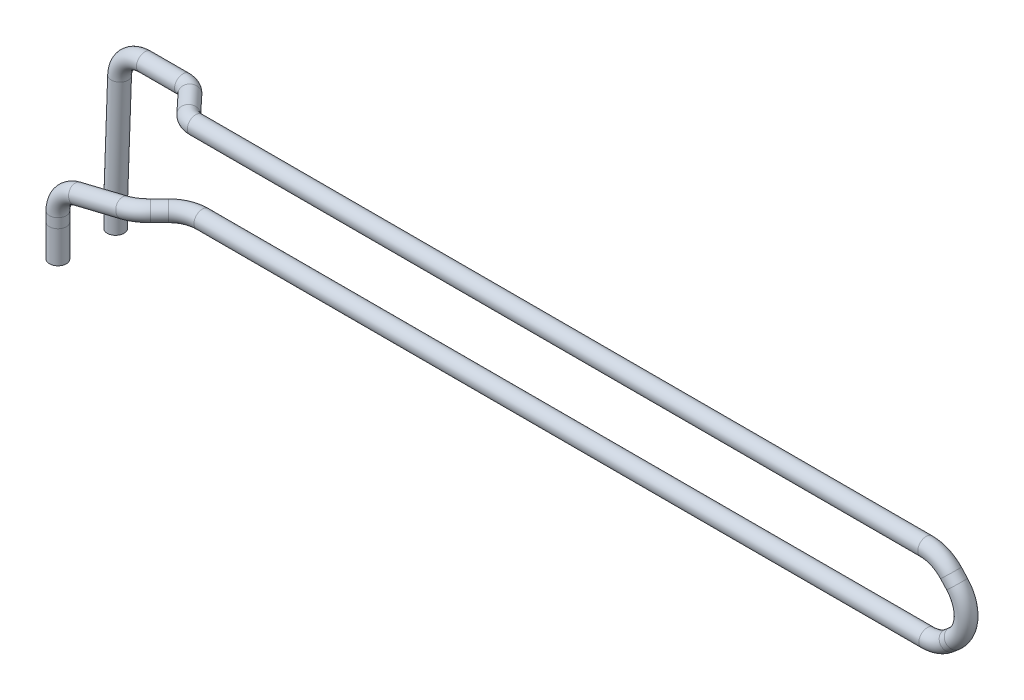
ISO-10303-21;
HEADER;
FILE_DESCRIPTION(('STEP AP214'),'2;1');
FILE_NAME('part.step','',(''),(''),'','','');
FILE_SCHEMA(('AUTOMOTIVE_DESIGN { 1 0 10303 214 1 1 1 1 }'));
ENDSEC;
DATA;
#1=APPLICATION_CONTEXT('core data for automotive mechanical design processes');
#2=APPLICATION_PROTOCOL_DEFINITION('international standard','automotive_design',2000,#1);
#3=PRODUCT_CONTEXT('',#1,'mechanical');
#4=PRODUCT('Part','Part','',(#3));
#5=PRODUCT_RELATED_PRODUCT_CATEGORY('part','',(#4));
#6=PRODUCT_DEFINITION_FORMATION('','',#4);
#7=PRODUCT_DEFINITION_CONTEXT('part definition',#1,'design');
#8=PRODUCT_DEFINITION('design','',#6,#7);
#9=PRODUCT_DEFINITION_SHAPE('','',#8);
#10=(LENGTH_UNIT() NAMED_UNIT(*) SI_UNIT(.MILLI.,.METRE.));
#11=(NAMED_UNIT(*) PLANE_ANGLE_UNIT() SI_UNIT($,.RADIAN.));
#12=(NAMED_UNIT(*) SI_UNIT($,.STERADIAN.) SOLID_ANGLE_UNIT());
#13=UNCERTAINTY_MEASURE_WITH_UNIT(LENGTH_MEASURE(1.E-05),#10,'distance_accuracy_value','');
#14=(GEOMETRIC_REPRESENTATION_CONTEXT(3) GLOBAL_UNCERTAINTY_ASSIGNED_CONTEXT((#13)) GLOBAL_UNIT_ASSIGNED_CONTEXT((#10,
#11,#12)) REPRESENTATION_CONTEXT('',''));
#15=CARTESIAN_POINT('',(0.,0.,0.));
#16=DIRECTION('',(0.,0.,1.));
#17=DIRECTION('',(1.,0.,0.));
#18=AXIS2_PLACEMENT_3D('',#15,#16,#17);
#19=CARTESIAN_POINT('',(-57.8477688580534,-14.4504268447309,-3.16147066816918));
#20=DIRECTION('',(0.,1.,0.));
#21=DIRECTION('',(0.,0.,1.));
#22=AXIS2_PLACEMENT_3D('',#19,#20,#21);
#23=PLANE('',#22);
#24=CARTESIAN_POINT('',(-57.8477688580534,-14.4504268447309,-3.16147066816918));
#25=DIRECTION('',(0.,1.,0.));
#26=DIRECTION('',(0.,0.,1.));
#27=AXIS2_PLACEMENT_3D('',#24,#25,#26);
#28=CIRCLE('',#27,1.);
#29=CARTESIAN_POINT('',(-57.8477688580534,-14.4504268447309,-2.16147066816917));
#30=VERTEX_POINT('',#29);
#31=EDGE_CURVE('E52',#30,#30,#28,.T.);
#32=ORIENTED_EDGE('',*,*,#31,.F.);
#33=EDGE_LOOP('',(#32));
#34=FACE_BOUND('',#33,.T.);
#35=ADVANCED_FACE('F49',(#34),#23,.F.);
#36=CARTESIAN_POINT('',(-58.0906123687134,-14.4017319108807,3.44671250446354));
#37=DIRECTION('',(0.,-1.,0.));
#38=DIRECTION('',(0.0991975804914857,0.,0.995067756499343));
#39=AXIS2_PLACEMENT_3D('',#36,#37,#38);
#40=PLANE('',#39);
#41=CARTESIAN_POINT('',(-58.0906123687134,-14.4017319108807,3.44671250446354));
#42=DIRECTION('',(0.,-1.,0.));
#43=DIRECTION('',(0.0991975804914857,0.,0.995067756499343));
#44=AXIS2_PLACEMENT_3D('',#41,#42,#43);
#45=CIRCLE('',#44,1.);
#46=CARTESIAN_POINT('',(-57.9914147882219,-14.4017319108807,4.44178026096289));
#47=VERTEX_POINT('',#46);
#48=EDGE_CURVE('E11',#47,#47,#45,.T.);
#49=ORIENTED_EDGE('',*,*,#48,.T.);
#50=EDGE_LOOP('',(#49));
#51=FACE_BOUND('',#50,.T.);
#52=ADVANCED_FACE('F78',(#51),#40,.T.);
#53=CARTESIAN_POINT('',(-57.8477688580534,-11.3655003498176,-3.16147066816918));
#54=DIRECTION('',(0.,-1.,0.));
#55=DIRECTION('',(0.,0.,-1.));
#56=AXIS2_PLACEMENT_3D('',#53,#54,#55);
#57=CYLINDRICAL_SURFACE('',#56,1.);
#58=CARTESIAN_POINT('',(-57.8477688580534,-11.5655003498176,-3.16147066816917));
#59=DIRECTION('',(-0.0178043012079039,-0.999841490866677,0.));
#60=DIRECTION('',(-0.999841490866677,0.0178043012079039,0.));
#61=AXIS2_PLACEMENT_3D('',#58,#59,#60);
#62=ELLIPSE('',#61,1.00015853426245,1.);
#63=CARTESIAN_POINT('',(-58.8477688580534,-11.547693226018,-3.16147066816917));
#64=VERTEX_POINT('',#63);
#65=EDGE_CURVE('E64',#64,#64,#62,.T.);
#66=ORIENTED_EDGE('',*,*,#65,.T.);
#67=EDGE_LOOP('',(#66));
#68=FACE_BOUND('',#67,.T.);
#69=ORIENTED_EDGE('',*,*,#31,.T.);
#70=EDGE_LOOP('',(#69));
#71=FACE_BOUND('',#70,.T.);
#72=ADVANCED_FACE('F75',(#68,#71),#57,.T.);
#73=CARTESIAN_POINT('',(-58.0906123687134,-14.4017319108807,3.44671250446354));
#74=DIRECTION('',(0.,1.,0.));
#75=DIRECTION('',(0.,0.,1.));
#76=AXIS2_PLACEMENT_3D('',#73,#74,#75);
#77=CYLINDRICAL_SURFACE('',#76,1.);
#78=CARTESIAN_POINT('',(-58.0906123687134,-10.5909190140778,3.44671250446355));
#79=DIRECTION('',(0.,-1.,0.));
#80=DIRECTION('',(0.0991975804914857,0.,0.995067756499343));
#81=AXIS2_PLACEMENT_3D('',#78,#79,#80);
#82=CIRCLE('',#81,1.);
#83=CARTESIAN_POINT('',(-57.9914147882219,-10.5909190140778,4.44178026096289));
#84=VERTEX_POINT('',#83);
#85=EDGE_CURVE('E56',#84,#84,#82,.T.);
#86=ORIENTED_EDGE('',*,*,#85,.T.);
#87=EDGE_LOOP('',(#86));
#88=FACE_BOUND('',#87,.T.);
#89=ORIENTED_EDGE('',*,*,#48,.F.);
#90=EDGE_LOOP('',(#89));
#91=FACE_BOUND('',#90,.T.);
#92=ADVANCED_FACE('F97',(#88,#91),#77,.T.);
#93=CARTESIAN_POINT('',(-58.0906123687134,-10.5909190140778,3.44671250446355));
#94=DIRECTION('',(0.,1.,0.));
#95=DIRECTION('',(0.,0.,1.));
#96=AXIS2_PLACEMENT_3D('',#93,#94,#95);
#97=CYLINDRICAL_SURFACE('',#96,1.);
#98=CARTESIAN_POINT('',(-58.0906123687134,-9.45535480034576,3.44671250446355));
#99=DIRECTION('',(0.,-1.,0.));
#100=DIRECTION('',(0.0991975804914857,0.,0.995067756499343));
#101=AXIS2_PLACEMENT_3D('',#98,#99,#100);
#102=CIRCLE('',#101,1.);
#103=CARTESIAN_POINT('',(-59.0906123687134,-9.45535480034576,3.44671250446355));
#104=VERTEX_POINT('',#103);
#105=EDGE_CURVE('E61',#104,#104,#102,.T.);
#106=ORIENTED_EDGE('',*,*,#105,.T.);
#107=EDGE_LOOP('',(#106));
#108=FACE_BOUND('',#107,.T.);
#109=ORIENTED_EDGE('',*,*,#85,.F.);
#110=EDGE_LOOP('',(#109));
#111=FACE_BOUND('',#110,.T.);
#112=ADVANCED_FACE('F103',(#108,#111),#97,.T.);
#113=CARTESIAN_POINT('',(-55.0906123687134,-9.45535480034575,3.44671250446355));
#114=DIRECTION('',(0.,0.,-1.));
#115=DIRECTION('',(-1.,0.,0.));
#116=AXIS2_PLACEMENT_3D('',#113,#114,#115);
#117=TOROIDAL_SURFACE('',#116,3.,1.);
#118=CARTESIAN_POINT('',(-55.8006105061255,-6.54058162823247,3.44671250446355));
#119=DIRECTION('',(-0.971591057371097,-0.236666045804028,0.));
#120=DIRECTION('',(0.0234766991282467,-0.0963794821183771,0.995067756499343));
#121=AXIS2_PLACEMENT_3D('',#118,#119,#120);
#122=CIRCLE('',#121,1.);
#123=CARTESIAN_POINT('',(-56.0372765519295,-5.56899057086137,3.44671250446355));
#124=VERTEX_POINT('',#123);
#125=EDGE_CURVE('E228',#124,#124,#122,.T.);
#126=CARTESIAN_POINT('',(-55.0906123687134,-9.45535480034575,3.44671250446355));
#127=DIRECTION('',(0.,0.,-1.));
#128=DIRECTION('',(-1.,0.,0.));
#129=AXIS2_PLACEMENT_3D('',#126,#127,#128);
#130=CIRCLE('',#129,4.);
#131=EDGE_CURVE('',#104,#124,#130,.T.);
#132=ORIENTED_EDGE('',*,*,#105,.F.);
#133=ORIENTED_EDGE('',*,*,#125,.T.);
#134=ORIENTED_EDGE('',*,*,#131,.T.);
#135=ORIENTED_EDGE('',*,*,#131,.F.);
#136=EDGE_LOOP('',(#132,#134,#133,#135));
#137=FACE_BOUND('',#136,.T.);
#138=ADVANCED_FACE('F108',(#137),#117,.T.);
#139=CARTESIAN_POINT('',(-55.8006105061255,-6.54058162823247,3.44671250446355));
#140=DIRECTION('',(0.971591057371097,0.236666045804028,0.));
#141=DIRECTION('',(-0.236666045804028,0.971591057371097,0.));
#142=AXIS2_PLACEMENT_3D('',#139,#140,#141);
#143=CYLINDRICAL_SURFACE('',#142,1.);
#144=CARTESIAN_POINT('',(-50.1950748013559,-5.17515122436409,3.44671250446355));
#145=DIRECTION('',(-0.971591057371097,-0.236666045804028,0.));
#146=DIRECTION('',(0.0234766991282467,-0.0963794821183771,0.995067756499343));
#147=AXIS2_PLACEMENT_3D('',#144,#145,#146);
#148=CIRCLE('',#147,1.);
#149=CARTESIAN_POINT('',(-50.2495799747924,-4.95138976795612,4.41983120056122));
#150=VERTEX_POINT('',#149);
#151=EDGE_CURVE('E225',#150,#150,#148,.T.);
#152=ORIENTED_EDGE('',*,*,#151,.T.);
#153=EDGE_LOOP('',(#152));
#154=FACE_BOUND('',#153,.T.);
#155=ORIENTED_EDGE('',*,*,#125,.F.);
#156=EDGE_LOOP('',(#155));
#157=FACE_BOUND('',#156,.T.);
#158=ADVANCED_FACE('F116',(#154,#157),#143,.T.);
#159=CARTESIAN_POINT('',(-50.0315592810462,-5.84643559358797,0.527356416170526));
#160=DIRECTION('',(-0.230304153903409,0.945473422889122,-0.230304153903404));
#161=DIRECTION('',(-0.971591057371097,-0.236666045804029,0.));
#162=AXIS2_PLACEMENT_3D('',#159,#160,#161);
#163=TOROIDAL_SURFACE('',#162,3.,1.);
#164=CARTESIAN_POINT('',(-48.0259072747765,-4.86933781982481,2.53300842244018));
#165=DIRECTION('',(-0.707106781186542,0.,0.707106781186553));
#166=DIRECTION('',(0.707106781186553,0.,0.707106781186542));
#167=AXIS2_PLACEMENT_3D('',#164,#165,#166);
#168=CIRCLE('',#167,1.);
#169=CARTESIAN_POINT('',(-47.3573566060199,-4.54363856190375,3.20155909119673));
#170=VERTEX_POINT('',#169);
#171=EDGE_CURVE('E222',#170,#170,#168,.T.);
#172=CARTESIAN_POINT('',(-50.0315592810462,-5.84643559358797,0.527356416170526));
#173=DIRECTION('',(-0.230304153903409,0.945473422889122,-0.230304153903404));
#174=DIRECTION('',(-0.971591057371097,-0.236666045804029,0.));
#175=AXIS2_PLACEMENT_3D('',#172,#173,#174);
#176=CIRCLE('',#175,4.);
#177=EDGE_CURVE('',#150,#170,#176,.T.);
#178=ORIENTED_EDGE('',*,*,#151,.F.);
#179=ORIENTED_EDGE('',*,*,#171,.T.);
#180=ORIENTED_EDGE('',*,*,#177,.T.);
#181=ORIENTED_EDGE('',*,*,#177,.F.);
#182=EDGE_LOOP('',(#178,#180,#179,#181));
#183=FACE_BOUND('',#182,.T.);
#184=ADVANCED_FACE('F123',(#183),#163,.T.);
#185=CARTESIAN_POINT('',(-48.0259072747765,-4.86933781982481,2.53300842244017));
#186=DIRECTION('',(0.707106781186541,0.,-0.707106781186554));
#187=DIRECTION('',(-0.707106781186554,0.,-0.707106781186541));
#188=AXIS2_PLACEMENT_3D('',#185,#186,#187);
#189=CYLINDRICAL_SURFACE('',#188,1.);
#190=CARTESIAN_POINT('',(-46.9440415045686,-4.86933781982481,1.45114265223225));
#191=DIRECTION('',(-0.707106781186541,0.,0.707106781186554));
#192=DIRECTION('',(0.707106781186554,0.,0.707106781186541));
#193=AXIS2_PLACEMENT_3D('',#190,#191,#192);
#194=CIRCLE('',#193,1.);
#195=CARTESIAN_POINT('',(-47.6511482857552,-4.86933781982481,0.744035871045712));
#196=VERTEX_POINT('',#195);
#197=EDGE_CURVE('E219',#196,#196,#194,.T.);
#198=ORIENTED_EDGE('',*,*,#197,.T.);
#199=EDGE_LOOP('',(#198));
#200=FACE_BOUND('',#199,.T.);
#201=ORIENTED_EDGE('',*,*,#171,.F.);
#202=EDGE_LOOP('',(#201));
#203=FACE_BOUND('',#202,.T.);
#204=ADVANCED_FACE('F127',(#200,#203),#189,.T.);
#205=CARTESIAN_POINT('',(-44.1156143798224,-4.8693378198248,4.27956977697841));
#206=DIRECTION('',(0.,-1.,0.));
#207=DIRECTION('',(0.,0.,-1.));
#208=AXIS2_PLACEMENT_3D('',#205,#206,#207);
#209=TOROIDAL_SURFACE('',#208,4.,1.);
#210=CARTESIAN_POINT('',(-44.1156143798224,-4.8693378198248,0.279569776978414));
#211=DIRECTION('',(-1.,0.,0.));
#212=DIRECTION('',(0.,0.,1.));
#213=AXIS2_PLACEMENT_3D('',#210,#211,#212);
#214=CIRCLE('',#213,1.);
#215=CARTESIAN_POINT('',(-44.1156143798224,-4.8693378198248,-0.720430223021586));
#216=VERTEX_POINT('',#215);
#217=EDGE_CURVE('E216',#216,#216,#214,.T.);
#218=CARTESIAN_POINT('',(-44.1156143798224,-4.8693378198248,4.27956977697841));
#219=DIRECTION('',(0.,-1.,0.));
#220=DIRECTION('',(0.,0.,-1.));
#221=AXIS2_PLACEMENT_3D('',#218,#219,#220);
#222=CIRCLE('',#221,5.);
#223=EDGE_CURVE('',#196,#216,#222,.T.);
#224=ORIENTED_EDGE('',*,*,#197,.F.);
#225=ORIENTED_EDGE('',*,*,#217,.T.);
#226=ORIENTED_EDGE('',*,*,#223,.T.);
#227=ORIENTED_EDGE('',*,*,#223,.F.);
#228=EDGE_LOOP('',(#224,#226,#225,#227));
#229=FACE_BOUND('',#228,.T.);
#230=ADVANCED_FACE('F131',(#229),#209,.T.);
#231=CARTESIAN_POINT('',(-44.1156143798224,-4.8693378198248,0.279569776978414));
#232=DIRECTION('',(1.,0.,0.));
#233=DIRECTION('',(0.,0.,-1.));
#234=AXIS2_PLACEMENT_3D('',#231,#232,#233);
#235=CYLINDRICAL_SURFACE('',#234,1.);
#236=CARTESIAN_POINT('',(41.8919105632454,-4.8693378198248,0.279569776978414));
#237=DIRECTION('',(-1.,0.,0.));
#238=DIRECTION('',(0.,0.,1.));
#239=AXIS2_PLACEMENT_3D('',#236,#237,#238);
#240=CIRCLE('',#239,1.);
#241=CARTESIAN_POINT('',(41.8919105632454,-5.8693378198248,0.279569776978414));
#242=VERTEX_POINT('',#241);
#243=EDGE_CURVE('E213',#242,#242,#240,.T.);
#244=ORIENTED_EDGE('',*,*,#243,.T.);
#245=EDGE_LOOP('',(#244));
#246=FACE_BOUND('',#245,.T.);
#247=ORIENTED_EDGE('',*,*,#217,.F.);
#248=EDGE_LOOP('',(#247));
#249=FACE_BOUND('',#248,.T.);
#250=ADVANCED_FACE('F135',(#246,#249),#235,.T.);
#251=CARTESIAN_POINT('',(41.8919105632455,-0.869337819824794,0.279569776978413));
#252=DIRECTION('',(0.,0.,1.));
#253=DIRECTION('',(0.,-1.,0.));
#254=AXIS2_PLACEMENT_3D('',#251,#252,#253);
#255=TOROIDAL_SURFACE('',#254,4.00000000000001,1.);
#256=CARTESIAN_POINT('',(44.4939840949807,-3.90729985636225,0.279569776978414));
#257=DIRECTION('',(-0.759490509134361,-0.650518382933818,0.));
#258=DIRECTION('',(0.,0.,1.));
#259=AXIS2_PLACEMENT_3D('',#256,#257,#258);
#260=CIRCLE('',#259,1.);
#261=CARTESIAN_POINT('',(45.1445024779145,-4.66679036549661,0.279569776978415));
#262=VERTEX_POINT('',#261);
#263=EDGE_CURVE('E210',#262,#262,#260,.T.);
#264=CARTESIAN_POINT('',(41.8919105632455,-0.869337819824794,0.279569776978413));
#265=DIRECTION('',(0.,0.,1.));
#266=DIRECTION('',(0.,-1.,0.));
#267=AXIS2_PLACEMENT_3D('',#264,#265,#266);
#268=CIRCLE('',#267,5.00000000000001);
#269=EDGE_CURVE('',#242,#262,#268,.T.);
#270=ORIENTED_EDGE('',*,*,#243,.F.);
#271=ORIENTED_EDGE('',*,*,#263,.T.);
#272=ORIENTED_EDGE('',*,*,#269,.T.);
#273=ORIENTED_EDGE('',*,*,#269,.F.);
#274=EDGE_LOOP('',(#270,#272,#271,#273));
#275=FACE_BOUND('',#274,.T.);
#276=ADVANCED_FACE('F139',(#275),#255,.T.);
#277=CARTESIAN_POINT('',(44.4939840949807,-3.90729985636224,0.279569776978413));
#278=DIRECTION('',(0.759490509134367,0.65051838293381,0.));
#279=DIRECTION('',(-0.65051838293381,0.759490509134367,0.));
#280=AXIS2_PLACEMENT_3D('',#277,#278,#279);
#281=CYLINDRICAL_SURFACE('',#280,1.);
#282=CARTESIAN_POINT('',(45.0971966572189,-3.39063657244609,0.279569776978413));
#283=DIRECTION('',(-0.759490509134367,-0.650518382933811,0.));
#284=DIRECTION('',(0.,0.,1.));
#285=AXIS2_PLACEMENT_3D('',#282,#283,#284);
#286=CIRCLE('',#285,1.);
#287=CARTESIAN_POINT('',(45.7477150401527,-4.15012708158046,0.279569776978413));
#288=VERTEX_POINT('',#287);
#289=EDGE_CURVE('E207',#288,#288,#286,.T.);
#290=ORIENTED_EDGE('',*,*,#289,.T.);
#291=EDGE_LOOP('',(#290));
#292=FACE_BOUND('',#291,.T.);
#293=ORIENTED_EDGE('',*,*,#263,.F.);
#294=EDGE_LOOP('',(#293));
#295=FACE_BOUND('',#294,.T.);
#296=ADVANCED_FACE('F143',(#292,#295),#281,.T.);
#297=CARTESIAN_POINT('',(42.4951231254836,-0.352674535908644,0.279569776978414));
#298=DIRECTION('',(0.,0.,1.));
#299=DIRECTION('',(0.,-1.,0.));
#300=AXIS2_PLACEMENT_3D('',#297,#298,#299);
#301=TOROIDAL_SURFACE('',#300,4.00000000000001,1.);
#302=CARTESIAN_POINT('',(45.4260549396111,2.36939061778166,0.279569776978413));
#303=DIRECTION('',(0.680516288422575,-0.732732953531887,0.));
#304=DIRECTION('',(0.,0.,1.));
#305=AXIS2_PLACEMENT_3D('',#302,#303,#304);
#306=CIRCLE('',#305,1.);
#307=CARTESIAN_POINT('',(46.158787893143,3.04990690620424,0.279569776978413));
#308=VERTEX_POINT('',#307);
#309=EDGE_CURVE('E204',#308,#308,#306,.T.);
#310=CARTESIAN_POINT('',(42.4951231254836,-0.352674535908644,0.279569776978414));
#311=DIRECTION('',(0.,0.,1.));
#312=DIRECTION('',(0.,-1.,0.));
#313=AXIS2_PLACEMENT_3D('',#310,#311,#312);
#314=CIRCLE('',#313,5.00000000000001);
#315=EDGE_CURVE('',#288,#308,#314,.T.);
#316=ORIENTED_EDGE('',*,*,#289,.F.);
#317=ORIENTED_EDGE('',*,*,#309,.T.);
#318=ORIENTED_EDGE('',*,*,#315,.T.);
#319=ORIENTED_EDGE('',*,*,#315,.F.);
#320=EDGE_LOOP('',(#316,#318,#317,#319));
#321=FACE_BOUND('',#320,.T.);
#322=ADVANCED_FACE('F147',(#321),#301,.T.);
#323=CARTESIAN_POINT('',(45.4260549396111,2.36939061778167,0.279569776978413));
#324=DIRECTION('',(-0.680516288422577,0.732732953531886,0.));
#325=DIRECTION('',(-0.732732953531886,-0.680516288422577,0.));
#326=AXIS2_PLACEMENT_3D('',#323,#324,#325);
#327=CYLINDRICAL_SURFACE('',#326,1.);
#328=CARTESIAN_POINT('',(44.6924518934593,3.15928372669292,0.279569776978413));
#329=DIRECTION('',(0.680516288422577,-0.732732953531886,0.));
#330=DIRECTION('',(0.,0.,1.));
#331=AXIS2_PLACEMENT_3D('',#328,#329,#330);
#332=CIRCLE('',#331,1.);
#333=CARTESIAN_POINT('',(45.4251848469911,3.83980001511549,0.279569776978413));
#334=VERTEX_POINT('',#333);
#335=EDGE_CURVE('E201',#334,#334,#332,.T.);
#336=ORIENTED_EDGE('',*,*,#335,.T.);
#337=EDGE_LOOP('',(#336));
#338=FACE_BOUND('',#337,.T.);
#339=ORIENTED_EDGE('',*,*,#309,.F.);
#340=EDGE_LOOP('',(#339));
#341=FACE_BOUND('',#340,.T.);
#342=ADVANCED_FACE('F151',(#338,#341),#327,.T.);
#343=CARTESIAN_POINT('',(41.7615200793317,0.43721857300261,0.279569776978413));
#344=DIRECTION('',(0.,0.,1.));
#345=DIRECTION('',(1.,0.,0.));
#346=AXIS2_PLACEMENT_3D('',#343,#344,#345);
#347=TOROIDAL_SURFACE('',#346,4.00000000000001,1.);
#348=CARTESIAN_POINT('',(41.7615200793317,4.43721857300262,0.279569776978413));
#349=DIRECTION('',(1.,0.,0.));
#350=DIRECTION('',(0.,0.,1.));
#351=AXIS2_PLACEMENT_3D('',#348,#349,#350);
#352=CIRCLE('',#351,1.);
#353=CARTESIAN_POINT('',(41.7615200793317,5.43721857300262,0.279569776978413));
#354=VERTEX_POINT('',#353);
#355=EDGE_CURVE('E198',#354,#354,#352,.T.);
#356=CARTESIAN_POINT('',(41.7615200793317,0.43721857300261,0.279569776978413));
#357=DIRECTION('',(0.,0.,1.));
#358=DIRECTION('',(1.,0.,0.));
#359=AXIS2_PLACEMENT_3D('',#356,#357,#358);
#360=CIRCLE('',#359,5.00000000000001);
#361=EDGE_CURVE('',#334,#354,#360,.T.);
#362=ORIENTED_EDGE('',*,*,#335,.F.);
#363=ORIENTED_EDGE('',*,*,#355,.T.);
#364=ORIENTED_EDGE('',*,*,#361,.T.);
#365=ORIENTED_EDGE('',*,*,#361,.F.);
#366=EDGE_LOOP('',(#362,#364,#363,#365));
#367=FACE_BOUND('',#366,.T.);
#368=ADVANCED_FACE('F155',(#367),#347,.T.);
#369=CARTESIAN_POINT('',(41.7615200793317,4.43721857300262,0.279569776978413));
#370=DIRECTION('',(-1.,0.,0.));
#371=DIRECTION('',(0.,0.,1.));
#372=AXIS2_PLACEMENT_3D('',#369,#370,#371);
#373=CYLINDRICAL_SURFACE('',#372,1.);
#374=CARTESIAN_POINT('',(-44.9063384066751,4.43721857300262,0.279569776978413));
#375=DIRECTION('',(1.,0.,0.));
#376=DIRECTION('',(0.,0.,1.));
#377=AXIS2_PLACEMENT_3D('',#374,#375,#376);
#378=CIRCLE('',#377,1.);
#379=CARTESIAN_POINT('',(-44.9063384066751,4.43721857300262,1.27956977697842));
#380=VERTEX_POINT('',#379);
#381=EDGE_CURVE('E195',#380,#380,#378,.T.);
#382=ORIENTED_EDGE('',*,*,#381,.T.);
#383=EDGE_LOOP('',(#382));
#384=FACE_BOUND('',#383,.T.);
#385=ORIENTED_EDGE('',*,*,#355,.F.);
#386=EDGE_LOOP('',(#385));
#387=FACE_BOUND('',#386,.T.);
#388=ADVANCED_FACE('F159',(#384,#387),#373,.T.);
#389=CARTESIAN_POINT('',(-44.9063384066751,4.43721857300262,-1.72043022302159));
#390=DIRECTION('',(0.,-1.,0.));
#391=DIRECTION('',(0.,0.,-1.));
#392=AXIS2_PLACEMENT_3D('',#389,#390,#391);
#393=TOROIDAL_SURFACE('',#392,2.,1.);
#394=CARTESIAN_POINT('',(-46.3669641166944,4.43721857300262,-0.354204569906223));
#395=DIRECTION('',(0.683112826557681,0.,0.730312855009671));
#396=DIRECTION('',(-0.730312855009671,0.,0.683112826557681));
#397=AXIS2_PLACEMENT_3D('',#394,#395,#396);
#398=CIRCLE('',#397,1.);
#399=CARTESIAN_POINT('',(-47.0972769717041,4.43721857300263,0.328908256651458));
#400=VERTEX_POINT('',#399);
#401=EDGE_CURVE('E189',#400,#400,#398,.T.);
#402=CARTESIAN_POINT('',(-44.9063384066751,4.43721857300262,-1.72043022302159));
#403=DIRECTION('',(0.,-1.,0.));
#404=DIRECTION('',(0.,0.,-1.));
#405=AXIS2_PLACEMENT_3D('',#402,#403,#404);
#406=CIRCLE('',#405,3.);
#407=EDGE_CURVE('',#380,#400,#406,.T.);
#408=ORIENTED_EDGE('',*,*,#381,.F.);
#409=ORIENTED_EDGE('',*,*,#401,.T.);
#410=ORIENTED_EDGE('',*,*,#407,.T.);
#411=ORIENTED_EDGE('',*,*,#407,.F.);
#412=EDGE_LOOP('',(#408,#410,#409,#411));
#413=FACE_BOUND('',#412,.T.);
#414=ADVANCED_FACE('F163',(#413),#393,.T.);
#415=CARTESIAN_POINT('',(-46.3669641166944,4.43721857300262,-0.354204569906223));
#416=DIRECTION('',(-0.683112826557684,0.,-0.730312855009667));
#417=DIRECTION('',(-0.730312855009667,0.,0.683112826557684));
#418=AXIS2_PLACEMENT_3D('',#415,#416,#417);
#419=CYLINDRICAL_SURFACE('',#418,1.);
#420=CARTESIAN_POINT('',(-48.3999833681003,4.43721857300262,-2.52769632128454));
#421=DIRECTION('',(0.683112826557684,0.,0.730312855009667));
#422=DIRECTION('',(-0.730312855009667,0.,0.683112826557684));
#423=AXIS2_PLACEMENT_3D('',#420,#421,#422);
#424=CIRCLE('',#423,1.);
#425=CARTESIAN_POINT('',(-47.6696705130907,4.43721857300261,-3.21080914784222));
#426=VERTEX_POINT('',#425);
#427=EDGE_CURVE('E186',#426,#426,#424,.T.);
#428=ORIENTED_EDGE('',*,*,#427,.T.);
#429=EDGE_LOOP('',(#428));
#430=FACE_BOUND('',#429,.T.);
#431=ORIENTED_EDGE('',*,*,#401,.F.);
#432=EDGE_LOOP('',(#431));
#433=FACE_BOUND('',#432,.T.);
#434=ADVANCED_FACE('F167',(#430,#433),#419,.T.);
#435=CARTESIAN_POINT('',(-49.8606090781197,4.43721857300262,-1.16147066816918));
#436=DIRECTION('',(0.,1.,0.));
#437=DIRECTION('',(0.,0.,1.));
#438=AXIS2_PLACEMENT_3D('',#435,#436,#437);
#439=TOROIDAL_SURFACE('',#438,2.,1.);
#440=CARTESIAN_POINT('',(-49.8606090781197,4.43721857300262,-3.16147066816917));
#441=DIRECTION('',(1.,0.,0.));
#442=DIRECTION('',(0.,0.,1.));
#443=AXIS2_PLACEMENT_3D('',#440,#441,#442);
#444=CIRCLE('',#443,1.);
#445=CARTESIAN_POINT('',(-49.8606090781197,4.43721857300261,-4.16147066816917));
#446=VERTEX_POINT('',#445);
#447=EDGE_CURVE('E185',#446,#446,#444,.T.);
#448=CARTESIAN_POINT('',(-49.8606090781197,4.43721857300262,-1.16147066816918));
#449=DIRECTION('',(0.,1.,0.));
#450=DIRECTION('',(0.,0.,1.));
#451=AXIS2_PLACEMENT_3D('',#448,#449,#450);
#452=CIRCLE('',#451,3.);
#453=EDGE_CURVE('',#426,#446,#452,.T.);
#454=ORIENTED_EDGE('',*,*,#427,.F.);
#455=ORIENTED_EDGE('',*,*,#447,.T.);
#456=ORIENTED_EDGE('',*,*,#453,.T.);
#457=ORIENTED_EDGE('',*,*,#453,.F.);
#458=EDGE_LOOP('',(#454,#456,#455,#457));
#459=FACE_BOUND('',#458,.T.);
#460=ADVANCED_FACE('F171',(#459),#439,.T.);
#461=CARTESIAN_POINT('',(-49.8606090781197,4.43721857300262,-3.16147066816917));
#462=DIRECTION('',(-1.,0.,0.));
#463=DIRECTION('',(0.,-1.,0.));
#464=AXIS2_PLACEMENT_3D('',#461,#462,#463);
#465=CYLINDRICAL_SURFACE('',#464,1.);
#466=CARTESIAN_POINT('',(-54.3826367544834,4.43721857300262,-3.16147066816917));
#467=DIRECTION('',(1.,0.,0.));
#468=DIRECTION('',(0.,0.,1.));
#469=AXIS2_PLACEMENT_3D('',#466,#467,#468);
#470=CIRCLE('',#469,1.);
#471=CARTESIAN_POINT('',(-54.3826367544834,5.43721857300262,-3.16147066816917));
#472=VERTEX_POINT('',#471);
#473=EDGE_CURVE('E70',#472,#472,#470,.T.);
#474=ORIENTED_EDGE('',*,*,#473,.T.);
#475=EDGE_LOOP('',(#474));
#476=FACE_BOUND('',#475,.T.);
#477=ORIENTED_EDGE('',*,*,#447,.F.);
#478=EDGE_LOOP('',(#477));
#479=FACE_BOUND('',#478,.T.);
#480=ADVANCED_FACE('F90',(#476,#479),#465,.T.);
#481=CARTESIAN_POINT('',(-54.3826367544834,1.43721857300261,-3.16147066816917));
#482=DIRECTION('',(0.,0.,1.));
#483=DIRECTION('',(0.,-1.,0.));
#484=AXIS2_PLACEMENT_3D('',#481,#482,#483);
#485=TOROIDAL_SURFACE('',#484,3.00000000000001,1.);
#486=CARTESIAN_POINT('',(-57.3807347956343,1.54402744738391,-3.16147066816917));
#487=DIRECTION('',(0.0356029581270999,0.999366013716997,0.));
#488=DIRECTION('',(0.,0.,1.));
#489=AXIS2_PLACEMENT_3D('',#486,#487,#488);
#490=CIRCLE('',#489,1.);
#491=CARTESIAN_POINT('',(-58.3801008093513,1.57963040551101,-3.16147066816917));
#492=VERTEX_POINT('',#491);
#493=EDGE_CURVE('E66',#492,#492,#490,.T.);
#494=CARTESIAN_POINT('',(-54.3826367544834,1.43721857300261,-3.16147066816917));
#495=DIRECTION('',(0.,0.,1.));
#496=DIRECTION('',(0.,-1.,0.));
#497=AXIS2_PLACEMENT_3D('',#494,#495,#496);
#498=CIRCLE('',#497,4.00000000000001);
#499=EDGE_CURVE('',#472,#492,#498,.T.);
#500=ORIENTED_EDGE('',*,*,#473,.F.);
#501=ORIENTED_EDGE('',*,*,#493,.T.);
#502=ORIENTED_EDGE('',*,*,#499,.T.);
#503=ORIENTED_EDGE('',*,*,#499,.F.);
#504=EDGE_LOOP('',(#500,#502,#501,#503));
#505=FACE_BOUND('',#504,.T.);
#506=ADVANCED_FACE('F84',(#505),#485,.T.);
#507=CARTESIAN_POINT('',(-57.3807347956343,1.54402744738391,-3.16147066816917));
#508=DIRECTION('',(-0.0356029581271,-0.999366013716996,0.));
#509=DIRECTION('',(0.999366013716997,-0.0356029581271,0.));
#510=AXIS2_PLACEMENT_3D('',#507,#508,#509);
#511=CYLINDRICAL_SURFACE('',#510,1.);
#512=ORIENTED_EDGE('',*,*,#493,.F.);
#513=EDGE_LOOP('',(#512));
#514=FACE_BOUND('',#513,.T.);
#515=ORIENTED_EDGE('',*,*,#65,.F.);
#516=EDGE_LOOP('',(#515));
#517=FACE_BOUND('',#516,.T.);
#518=ADVANCED_FACE('F82',(#514,#517),#511,.T.);
#519=CLOSED_SHELL('',(#35,#52,#72,#92,#112,#138,#158,#184,#204,#230,#250,#276,#296,#322,#342,
#368,#388,#414,#434,#460,#480,#506,#518));
#520=MANIFOLD_SOLID_BREP('B2',#519);
#521=ADVANCED_BREP_SHAPE_REPRESENTATION('',(#18,#520),#14);
#522=SHAPE_DEFINITION_REPRESENTATION(#9,#521);
ENDSEC;
END-ISO-10303-21;
